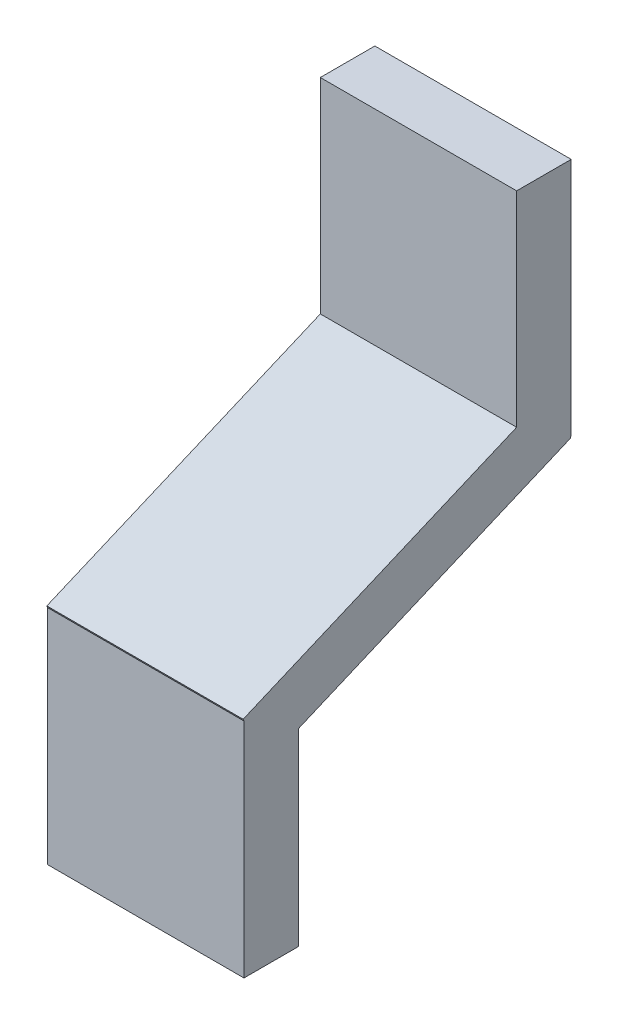
ISO-10303-21;
HEADER;
FILE_DESCRIPTION(('STEP AP214'),'2;1');
FILE_NAME('part.step','',(''),(''),'','','');
FILE_SCHEMA(('AUTOMOTIVE_DESIGN { 1 0 10303 214 1 1 1 1 }'));
ENDSEC;
DATA;
#1=APPLICATION_CONTEXT('core data for automotive mechanical design processes');
#2=APPLICATION_PROTOCOL_DEFINITION('international standard','automotive_design',2000,#1);
#3=PRODUCT_CONTEXT('',#1,'mechanical');
#4=PRODUCT('Part','Part','',(#3));
#5=PRODUCT_RELATED_PRODUCT_CATEGORY('part','',(#4));
#6=PRODUCT_DEFINITION_FORMATION('','',#4);
#7=PRODUCT_DEFINITION_CONTEXT('part definition',#1,'design');
#8=PRODUCT_DEFINITION('design','',#6,#7);
#9=PRODUCT_DEFINITION_SHAPE('','',#8);
#10=(LENGTH_UNIT() NAMED_UNIT(*) SI_UNIT(.MILLI.,.METRE.));
#11=(NAMED_UNIT(*) PLANE_ANGLE_UNIT() SI_UNIT($,.RADIAN.));
#12=(NAMED_UNIT(*) SI_UNIT($,.STERADIAN.) SOLID_ANGLE_UNIT());
#13=UNCERTAINTY_MEASURE_WITH_UNIT(LENGTH_MEASURE(1.E-05),#10,'distance_accuracy_value','');
#14=(GEOMETRIC_REPRESENTATION_CONTEXT(3) GLOBAL_UNCERTAINTY_ASSIGNED_CONTEXT((#13)) GLOBAL_UNIT_ASSIGNED_CONTEXT((#10,
#11,#12)) REPRESENTATION_CONTEXT('',''));
#15=CARTESIAN_POINT('',(0.,0.,0.));
#16=DIRECTION('',(0.,0.,1.));
#17=DIRECTION('',(1.,0.,0.));
#18=AXIS2_PLACEMENT_3D('',#15,#16,#17);
#19=CARTESIAN_POINT('',(2.62,11.,0.5));
#20=DIRECTION('',(0.,0.,1.));
#21=DIRECTION('',(1.,0.,0.));
#22=AXIS2_PLACEMENT_3D('',#19,#20,#21);
#23=PLANE('',#22);
#24=DIRECTION('',(1.,0.,0.));
#25=VECTOR('',#24,1.);
#26=CARTESIAN_POINT('',(2.62,11.3461054439247,0.500000000000314));
#27=LINE('',#26,#25);
#28=CARTESIAN_POINT('',(2.980000014305,11.3461054439242,0.500000000000105));
#29=VERTEX_POINT('',#28);
#30=CARTESIAN_POINT('',(2.62,11.3461054439243,0.500000000000105));
#31=VERTEX_POINT('',#30);
#32=EDGE_CURVE('E148',#29,#31,#27,.F.);
#33=ORIENTED_EDGE('',*,*,#32,.F.);
#34=DIRECTION('',(0.,1.,0.));
#35=VECTOR('',#34,1.);
#36=CARTESIAN_POINT('',(2.980000014305,11.65,0.5));
#37=LINE('',#36,#35);
#38=CARTESIAN_POINT('',(2.980000014305,11.,0.5));
#39=VERTEX_POINT('',#38);
#40=EDGE_CURVE('E154',#39,#29,#37,.T.);
#41=ORIENTED_EDGE('',*,*,#40,.F.);
#42=DIRECTION('',(1.,0.,0.));
#43=VECTOR('',#42,1.);
#44=CARTESIAN_POINT('',(2.62,11.,0.5));
#45=LINE('',#44,#43);
#46=CARTESIAN_POINT('',(2.62,11.,0.5));
#47=VERTEX_POINT('',#46);
#48=EDGE_CURVE('E135',#39,#47,#45,.F.);
#49=ORIENTED_EDGE('',*,*,#48,.T.);
#50=DIRECTION('',(0.,1.,0.));
#51=VECTOR('',#50,1.);
#52=CARTESIAN_POINT('',(2.62,11.65,0.5));
#53=LINE('',#52,#51);
#54=EDGE_CURVE('E182',#47,#31,#53,.T.);
#55=ORIENTED_EDGE('',*,*,#54,.T.);
#56=EDGE_LOOP('',(#33,#41,#49,#55));
#57=FACE_BOUND('',#56,.T.);
#58=ADVANCED_FACE('F17',(#57),#23,.F.);
#59=CARTESIAN_POINT('',(2.62,11.557949520001,0.0009268707435866));
#60=DIRECTION('',(0.,-0.920504786278108,-0.390731286742046));
#61=DIRECTION('',(0.,0.390731286742046,-0.920504786278108));
#62=AXIS2_PLACEMENT_3D('',#59,#60,#61);
#63=PLANE('',#62);
#64=DIRECTION('',(0.,0.39073128674346,-0.920504786277508));
#65=VECTOR('',#64,1.);
#66=CARTESIAN_POINT('',(2.980000014305,11.346105443924,0.5));
#67=LINE('',#66,#65);
#68=CARTESIAN_POINT('',(2.980000014305,11.557949520001,0.000926870743687937));
#69=VERTEX_POINT('',#68);
#70=EDGE_CURVE('E151',#29,#69,#67,.T.);
#71=ORIENTED_EDGE('',*,*,#70,.F.);
#72=ORIENTED_EDGE('',*,*,#32,.T.);
#73=DIRECTION('',(0.,0.39073128674346,-0.920504786277508));
#74=VECTOR('',#73,1.);
#75=CARTESIAN_POINT('',(2.62,11.346105443924,0.5));
#76=LINE('',#75,#74);
#77=CARTESIAN_POINT('',(2.62,11.557949520001,0.000926870743697301));
#78=VERTEX_POINT('',#77);
#79=EDGE_CURVE('E178',#31,#78,#76,.T.);
#80=ORIENTED_EDGE('',*,*,#79,.T.);
#81=DIRECTION('',(1.,0.,0.));
#82=VECTOR('',#81,1.);
#83=CARTESIAN_POINT('',(2.62,11.557949520001,0.00092687074374427));
#84=LINE('',#83,#82);
#85=EDGE_CURVE('E145',#78,#69,#84,.T.);
#86=ORIENTED_EDGE('',*,*,#85,.T.);
#87=EDGE_LOOP('',(#71,#72,#80,#86));
#88=FACE_BOUND('',#87,.T.);
#89=ADVANCED_FACE('F242',(#88),#63,.T.);
#90=CARTESIAN_POINT('',(2.62,11.65,0.04));
#91=DIRECTION('',(0.,-0.390731286742046,0.920504786278108));
#92=DIRECTION('',(0.,-0.920504786278108,-0.390731286742046));
#93=AXIS2_PLACEMENT_3D('',#90,#91,#92);
#94=PLANE('',#93);
#95=DIRECTION('',(0.,0.920504786259214,0.390731286786557));
#96=VECTOR('',#95,1.);
#97=CARTESIAN_POINT('',(2.62,11.557949520001,0.000926870743659899));
#98=LINE('',#97,#96);
#99=CARTESIAN_POINT('',(2.62,11.56,0.001797248280528));
#100=VERTEX_POINT('',#99);
#101=EDGE_CURVE('E123',#78,#100,#98,.T.);
#102=ORIENTED_EDGE('',*,*,#101,.T.);
#103=DIRECTION('',(1.,0.,0.));
#104=VECTOR('',#103,1.);
#105=CARTESIAN_POINT('',(2.62,11.56,0.001797248280528));
#106=LINE('',#105,#104);
#107=CARTESIAN_POINT('',(2.980000014305,11.56,0.001797248280528));
#108=VERTEX_POINT('',#107);
#109=EDGE_CURVE('E97',#100,#108,#106,.T.);
#110=ORIENTED_EDGE('',*,*,#109,.T.);
#111=DIRECTION('',(0.,0.920504786259214,0.390731286786557));
#112=VECTOR('',#111,1.);
#113=CARTESIAN_POINT('',(2.980000014305,11.557949520001,0.000926870743659899));
#114=LINE('',#113,#112);
#115=EDGE_CURVE('E153',#69,#108,#114,.T.);
#116=ORIENTED_EDGE('',*,*,#115,.F.);
#117=ORIENTED_EDGE('',*,*,#85,.F.);
#118=EDGE_LOOP('',(#102,#110,#116,#117));
#119=FACE_BOUND('',#118,.T.);
#120=ADVANCED_FACE('F243',(#119),#94,.F.);
#121=CARTESIAN_POINT('',(2.62,11.56,0.));
#122=DIRECTION('',(0.,1.,0.));
#123=DIRECTION('',(0.,0.,1.));
#124=AXIS2_PLACEMENT_3D('',#121,#122,#123);
#125=PLANE('',#124);
#126=ORIENTED_EDGE('',*,*,#109,.F.);
#127=DIRECTION('',(0.,0.,1.));
#128=VECTOR('',#127,1.);
#129=CARTESIAN_POINT('',(2.62,11.56,0.));
#130=LINE('',#129,#128);
#131=CARTESIAN_POINT('',(2.62,11.56,0.));
#132=VERTEX_POINT('',#131);
#133=EDGE_CURVE('E20',#100,#132,#130,.F.);
#134=ORIENTED_EDGE('',*,*,#133,.T.);
#135=DIRECTION('',(1.,0.,0.));
#136=VECTOR('',#135,1.);
#137=CARTESIAN_POINT('',(2.62,11.56,0.));
#138=LINE('',#137,#136);
#139=CARTESIAN_POINT('',(2.980000014305,11.56,0.));
#140=VERTEX_POINT('',#139);
#141=EDGE_CURVE('E104',#132,#140,#138,.T.);
#142=ORIENTED_EDGE('',*,*,#141,.T.);
#143=DIRECTION('',(0.,0.,-1.));
#144=VECTOR('',#143,1.);
#145=CARTESIAN_POINT('',(2.980000014305,11.56,0.04));
#146=LINE('',#145,#144);
#147=EDGE_CURVE('E194',#108,#140,#146,.T.);
#148=ORIENTED_EDGE('',*,*,#147,.F.);
#149=EDGE_LOOP('',(#126,#134,#142,#148));
#150=FACE_BOUND('',#149,.T.);
#151=ADVANCED_FACE('F122',(#150),#125,.F.);
#152=CARTESIAN_POINT('',(2.62,11.56,0.));
#153=DIRECTION('',(0.,0.,1.));
#154=DIRECTION('',(1.,0.,0.));
#155=AXIS2_PLACEMENT_3D('',#152,#153,#154);
#156=PLANE('',#155);
#157=ORIENTED_EDGE('',*,*,#141,.F.);
#158=DIRECTION('',(0.,1.,0.));
#159=VECTOR('',#158,1.);
#160=CARTESIAN_POINT('',(2.62,11.65,0.));
#161=LINE('',#160,#159);
#162=CARTESIAN_POINT('',(2.62,11.999999997616,0.));
#163=VERTEX_POINT('',#162);
#164=EDGE_CURVE('E108',#132,#163,#161,.T.);
#165=ORIENTED_EDGE('',*,*,#164,.T.);
#166=DIRECTION('',(1.,0.,0.));
#167=VECTOR('',#166,1.);
#168=CARTESIAN_POINT('',(2.62,11.999999997616,0.));
#169=LINE('',#168,#167);
#170=CARTESIAN_POINT('',(2.980000014305,11.999999997616,0.));
#171=VERTEX_POINT('',#170);
#172=EDGE_CURVE('E110',#171,#163,#169,.F.);
#173=ORIENTED_EDGE('',*,*,#172,.F.);
#174=DIRECTION('',(0.,1.,0.));
#175=VECTOR('',#174,1.);
#176=CARTESIAN_POINT('',(2.980000014305,11.65,0.));
#177=LINE('',#176,#175);
#178=EDGE_CURVE('E109',#140,#171,#177,.T.);
#179=ORIENTED_EDGE('',*,*,#178,.F.);
#180=EDGE_LOOP('',(#157,#165,#173,#179));
#181=FACE_BOUND('',#180,.T.);
#182=ADVANCED_FACE('F106',(#181),#156,.F.);
#183=CARTESIAN_POINT('',(2.62,11.999999997616,0.));
#184=DIRECTION('',(0.,1.,0.));
#185=DIRECTION('',(0.,0.,1.));
#186=AXIS2_PLACEMENT_3D('',#183,#184,#185);
#187=PLANE('',#186);
#188=ORIENTED_EDGE('',*,*,#172,.T.);
#189=DIRECTION('',(0.,0.,-1.));
#190=VECTOR('',#189,1.);
#191=CARTESIAN_POINT('',(2.62,11.999999997616,0.04));
#192=LINE('',#191,#190);
#193=CARTESIAN_POINT('',(2.62,11.999999997616,0.10000000149));
#194=VERTEX_POINT('',#193);
#195=EDGE_CURVE('E120',#163,#194,#192,.F.);
#196=ORIENTED_EDGE('',*,*,#195,.T.);
#197=DIRECTION('',(1.,0.,0.));
#198=VECTOR('',#197,1.);
#199=CARTESIAN_POINT('',(2.62,11.999999997616,0.10000000149));
#200=LINE('',#199,#198);
#201=CARTESIAN_POINT('',(2.980000014305,11.999999997616,0.10000000149));
#202=VERTEX_POINT('',#201);
#203=EDGE_CURVE('E181',#202,#194,#200,.F.);
#204=ORIENTED_EDGE('',*,*,#203,.F.);
#205=DIRECTION('',(0.,0.,-1.));
#206=VECTOR('',#205,1.);
#207=CARTESIAN_POINT('',(2.980000014305,11.999999997616,0.04));
#208=LINE('',#207,#206);
#209=EDGE_CURVE('E140',#171,#202,#208,.F.);
#210=ORIENTED_EDGE('',*,*,#209,.F.);
#211=EDGE_LOOP('',(#188,#196,#204,#210));
#212=FACE_BOUND('',#211,.T.);
#213=ADVANCED_FACE('F271',(#212),#187,.T.);
#214=CARTESIAN_POINT('',(2.62,11.,0.60000000149));
#215=DIRECTION('',(0.,0.,1.));
#216=DIRECTION('',(1.,0.,0.));
#217=AXIS2_PLACEMENT_3D('',#214,#215,#216);
#218=PLANE('',#217);
#219=DIRECTION('',(0.,1.,0.));
#220=VECTOR('',#219,1.);
#221=CARTESIAN_POINT('',(2.980000014305,11.65,0.60000000149));
#222=LINE('',#221,#220);
#223=CARTESIAN_POINT('',(2.980000014305,11.408101447657,0.600000001490072));
#224=VERTEX_POINT('',#223);
#225=CARTESIAN_POINT('',(2.980000014305,11.,0.60000000149));
#226=VERTEX_POINT('',#225);
#227=EDGE_CURVE('E168',#224,#226,#222,.F.);
#228=ORIENTED_EDGE('',*,*,#227,.F.);
#229=DIRECTION('',(1.,0.,0.));
#230=VECTOR('',#229,1.);
#231=CARTESIAN_POINT('',(2.62,11.4081014476569,0.600000001490144));
#232=LINE('',#231,#230);
#233=CARTESIAN_POINT('',(2.62,11.408101447657,0.600000001490072));
#234=VERTEX_POINT('',#233);
#235=EDGE_CURVE('E124',#234,#224,#232,.T.);
#236=ORIENTED_EDGE('',*,*,#235,.F.);
#237=DIRECTION('',(0.,1.,0.));
#238=VECTOR('',#237,1.);
#239=CARTESIAN_POINT('',(2.62,11.65,0.60000000149));
#240=LINE('',#239,#238);
#241=CARTESIAN_POINT('',(2.62,11.,0.60000000149));
#242=VERTEX_POINT('',#241);
#243=EDGE_CURVE('E192',#234,#242,#240,.F.);
#244=ORIENTED_EDGE('',*,*,#243,.T.);
#245=DIRECTION('',(1.,0.,0.));
#246=VECTOR('',#245,1.);
#247=CARTESIAN_POINT('',(2.62,11.,0.60000000149));
#248=LINE('',#247,#246);
#249=EDGE_CURVE('E127',#242,#226,#248,.T.);
#250=ORIENTED_EDGE('',*,*,#249,.T.);
#251=EDGE_LOOP('',(#228,#236,#244,#250));
#252=FACE_BOUND('',#251,.T.);
#253=ADVANCED_FACE('F232',(#252),#218,.T.);
#254=CARTESIAN_POINT('',(2.62,11.,0.5));
#255=DIRECTION('',(0.,1.,0.));
#256=DIRECTION('',(0.,0.,1.));
#257=AXIS2_PLACEMENT_3D('',#254,#255,#256);
#258=PLANE('',#257);
#259=DIRECTION('',(0.,0.,-1.));
#260=VECTOR('',#259,1.);
#261=CARTESIAN_POINT('',(2.62,11.,0.04));
#262=LINE('',#261,#260);
#263=EDGE_CURVE('E187',#242,#47,#262,.T.);
#264=ORIENTED_EDGE('',*,*,#263,.T.);
#265=ORIENTED_EDGE('',*,*,#48,.F.);
#266=DIRECTION('',(0.,0.,-1.));
#267=VECTOR('',#266,1.);
#268=CARTESIAN_POINT('',(2.980000014305,11.,0.04));
#269=LINE('',#268,#267);
#270=EDGE_CURVE('E164',#226,#39,#269,.T.);
#271=ORIENTED_EDGE('',*,*,#270,.F.);
#272=ORIENTED_EDGE('',*,*,#249,.F.);
#273=EDGE_LOOP('',(#264,#265,#271,#272));
#274=FACE_BOUND('',#273,.T.);
#275=ADVANCED_FACE('F235',(#274),#258,.F.);
#276=CARTESIAN_POINT('',(2.62,11.411653909498,0.601507932798));
#277=DIRECTION('',(0.,-0.390731286742046,0.920504786278108));
#278=DIRECTION('',(0.,-0.920504786278108,-0.390731286742046));
#279=AXIS2_PLACEMENT_3D('',#276,#277,#278);
#280=PLANE('',#279);
#281=ORIENTED_EDGE('',*,*,#235,.T.);
#282=DIRECTION('',(0.,-0.920504786262243,-0.390731286779422));
#283=VECTOR('',#282,1.);
#284=CARTESIAN_POINT('',(2.980000014305,11.411653909498,0.601507932798));
#285=LINE('',#284,#283);
#286=CARTESIAN_POINT('',(2.980000014305,11.4116539094979,0.601507932797974));
#287=VERTEX_POINT('',#286);
#288=EDGE_CURVE('E227',#287,#224,#285,.T.);
#289=ORIENTED_EDGE('',*,*,#288,.F.);
#290=DIRECTION('',(1.,0.,0.));
#291=VECTOR('',#290,1.);
#292=CARTESIAN_POINT('',(2.62,11.4116539094978,0.601507932797897));
#293=LINE('',#292,#291);
#294=CARTESIAN_POINT('',(2.62,11.4116539094979,0.601507932797974));
#295=VERTEX_POINT('',#294);
#296=EDGE_CURVE('E167',#287,#295,#293,.F.);
#297=ORIENTED_EDGE('',*,*,#296,.T.);
#298=DIRECTION('',(0.,-0.920504786262243,-0.390731286779422));
#299=VECTOR('',#298,1.);
#300=CARTESIAN_POINT('',(2.62,11.411653909498,0.601507932798));
#301=LINE('',#300,#299);
#302=EDGE_CURVE('E175',#295,#234,#301,.T.);
#303=ORIENTED_EDGE('',*,*,#302,.T.);
#304=EDGE_LOOP('',(#281,#289,#297,#303));
#305=FACE_BOUND('',#304,.T.);
#306=ADVANCED_FACE('F210',(#305),#280,.T.);
#307=CARTESIAN_POINT('',(2.62,11.65,0.04));
#308=DIRECTION('',(1.,0.,0.));
#309=DIRECTION('',(0.,0.,-1.));
#310=AXIS2_PLACEMENT_3D('',#307,#308,#309);
#311=PLANE('',#310);
#312=ORIENTED_EDGE('',*,*,#54,.F.);
#313=ORIENTED_EDGE('',*,*,#263,.F.);
#314=ORIENTED_EDGE('',*,*,#243,.F.);
#315=ORIENTED_EDGE('',*,*,#302,.F.);
#316=DIRECTION('',(0.,0.390731286742046,-0.920504786278108));
#317=VECTOR('',#316,1.);
#318=CARTESIAN_POINT('',(2.62,11.65,0.04));
#319=LINE('',#318,#317);
#320=CARTESIAN_POINT('',(2.62,11.624531498221,0.100000001490019));
#321=VERTEX_POINT('',#320);
#322=EDGE_CURVE('E216',#295,#321,#319,.T.);
#323=ORIENTED_EDGE('',*,*,#322,.T.);
#324=DIRECTION('',(0.,1.,0.));
#325=VECTOR('',#324,1.);
#326=CARTESIAN_POINT('',(2.62,11.56,0.10000000149));
#327=LINE('',#326,#325);
#328=EDGE_CURVE('E161',#194,#321,#327,.F.);
#329=ORIENTED_EDGE('',*,*,#328,.F.);
#330=ORIENTED_EDGE('',*,*,#195,.F.);
#331=ORIENTED_EDGE('',*,*,#164,.F.);
#332=ORIENTED_EDGE('',*,*,#133,.F.);
#333=ORIENTED_EDGE('',*,*,#101,.F.);
#334=ORIENTED_EDGE('',*,*,#79,.F.);
#335=EDGE_LOOP('',(#312,#313,#314,#315,#323,#329,#330,#331,#332,#333,#334));
#336=FACE_BOUND('',#335,.T.);
#337=ADVANCED_FACE('F115',(#336),#311,.F.);
#338=CARTESIAN_POINT('',(2.62,11.56,0.10000000149));
#339=DIRECTION('',(0.,0.,1.));
#340=DIRECTION('',(1.,0.,0.));
#341=AXIS2_PLACEMENT_3D('',#338,#339,#340);
#342=PLANE('',#341);
#343=ORIENTED_EDGE('',*,*,#328,.T.);
#344=DIRECTION('',(1.,0.,0.));
#345=VECTOR('',#344,1.);
#346=CARTESIAN_POINT('',(2.62,11.6245314982212,0.100000001490075));
#347=LINE('',#346,#345);
#348=CARTESIAN_POINT('',(2.980000014305,11.624531498221,0.100000001490019));
#349=VERTEX_POINT('',#348);
#350=EDGE_CURVE('E26',#321,#349,#347,.T.);
#351=ORIENTED_EDGE('',*,*,#350,.T.);
#352=DIRECTION('',(0.,1.,0.));
#353=VECTOR('',#352,1.);
#354=CARTESIAN_POINT('',(2.980000014305,11.65,0.10000000149));
#355=LINE('',#354,#353);
#356=EDGE_CURVE('E34',#202,#349,#355,.F.);
#357=ORIENTED_EDGE('',*,*,#356,.F.);
#358=ORIENTED_EDGE('',*,*,#203,.T.);
#359=EDGE_LOOP('',(#343,#351,#357,#358));
#360=FACE_BOUND('',#359,.T.);
#361=ADVANCED_FACE('F257',(#360),#342,.T.);
#362=CARTESIAN_POINT('',(2.980000014305,11.65,0.04));
#363=DIRECTION('',(1.,0.,0.));
#364=DIRECTION('',(0.,0.,-1.));
#365=AXIS2_PLACEMENT_3D('',#362,#363,#364);
#366=PLANE('',#365);
#367=ORIENTED_EDGE('',*,*,#227,.T.);
#368=ORIENTED_EDGE('',*,*,#270,.T.);
#369=ORIENTED_EDGE('',*,*,#40,.T.);
#370=ORIENTED_EDGE('',*,*,#70,.T.);
#371=ORIENTED_EDGE('',*,*,#115,.T.);
#372=ORIENTED_EDGE('',*,*,#147,.T.);
#373=ORIENTED_EDGE('',*,*,#178,.T.);
#374=ORIENTED_EDGE('',*,*,#209,.T.);
#375=ORIENTED_EDGE('',*,*,#356,.T.);
#376=DIRECTION('',(0.,0.390731286742046,-0.920504786278108));
#377=VECTOR('',#376,1.);
#378=CARTESIAN_POINT('',(2.980000014305,11.65,0.04));
#379=LINE('',#378,#377);
#380=EDGE_CURVE('E11',#349,#287,#379,.F.);
#381=ORIENTED_EDGE('',*,*,#380,.T.);
#382=ORIENTED_EDGE('',*,*,#288,.T.);
#383=EDGE_LOOP('',(#367,#368,#369,#370,#371,#372,#373,#374,#375,#381,#382));
#384=FACE_BOUND('',#383,.T.);
#385=ADVANCED_FACE('F230',(#384),#366,.T.);
#386=CARTESIAN_POINT('',(2.62,11.65,0.04));
#387=DIRECTION('',(0.,-0.920504786278108,-0.390731286742046));
#388=DIRECTION('',(0.,0.390731286742046,-0.920504786278108));
#389=AXIS2_PLACEMENT_3D('',#386,#387,#388);
#390=PLANE('',#389);
#391=ORIENTED_EDGE('',*,*,#350,.F.);
#392=ORIENTED_EDGE('',*,*,#322,.F.);
#393=ORIENTED_EDGE('',*,*,#296,.F.);
#394=ORIENTED_EDGE('',*,*,#380,.F.);
#395=EDGE_LOOP('',(#391,#392,#393,#394));
#396=FACE_BOUND('',#395,.T.);
#397=ADVANCED_FACE('F220',(#396),#390,.F.);
#398=CLOSED_SHELL('',(#58,#89,#120,#151,#182,#213,#253,#275,#306,#337,#361,#385,#397));
#399=MANIFOLD_SOLID_BREP('B1',#398);
#400=ADVANCED_BREP_SHAPE_REPRESENTATION('',(#18,#399),#14);
#401=SHAPE_DEFINITION_REPRESENTATION(#9,#400);
ENDSEC;
END-ISO-10303-21;
